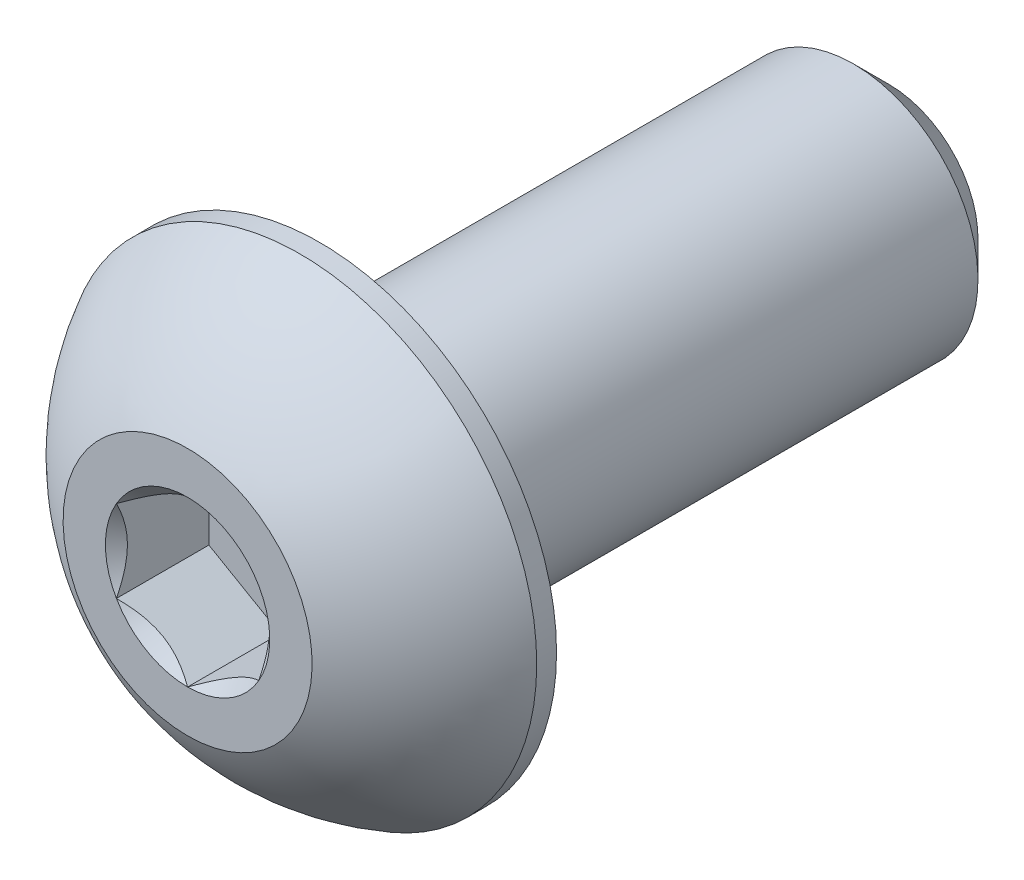
ISO-10303-21;
HEADER;
FILE_DESCRIPTION(('STEP AP214'),'2;1');
FILE_NAME('part.step','',(''),(''),'','','');
FILE_SCHEMA(('AUTOMOTIVE_DESIGN { 1 0 10303 214 1 1 1 1 }'));
ENDSEC;
DATA;
#1=APPLICATION_CONTEXT('core data for automotive mechanical design processes');
#2=APPLICATION_PROTOCOL_DEFINITION('international standard','automotive_design',2000,#1);
#3=PRODUCT_CONTEXT('',#1,'mechanical');
#4=PRODUCT('Part','Part','',(#3));
#5=PRODUCT_RELATED_PRODUCT_CATEGORY('part','',(#4));
#6=PRODUCT_DEFINITION_FORMATION('','',#4);
#7=PRODUCT_DEFINITION_CONTEXT('part definition',#1,'design');
#8=PRODUCT_DEFINITION('design','',#6,#7);
#9=PRODUCT_DEFINITION_SHAPE('','',#8);
#10=(LENGTH_UNIT() NAMED_UNIT(*) SI_UNIT(.MILLI.,.METRE.));
#11=(NAMED_UNIT(*) PLANE_ANGLE_UNIT() SI_UNIT($,.RADIAN.));
#12=(NAMED_UNIT(*) SI_UNIT($,.STERADIAN.) SOLID_ANGLE_UNIT());
#13=UNCERTAINTY_MEASURE_WITH_UNIT(LENGTH_MEASURE(1.E-05),#10,'distance_accuracy_value','');
#14=(GEOMETRIC_REPRESENTATION_CONTEXT(3) GLOBAL_UNCERTAINTY_ASSIGNED_CONTEXT((#13)) GLOBAL_UNIT_ASSIGNED_CONTEXT((#10,
#11,#12)) REPRESENTATION_CONTEXT('',''));
#15=CARTESIAN_POINT('',(0.,0.,0.));
#16=DIRECTION('',(0.,0.,1.));
#17=DIRECTION('',(1.,0.,0.));
#18=AXIS2_PLACEMENT_3D('',#15,#16,#17);
#19=CARTESIAN_POINT('',(0.,-2.08280000000001,-11.7348));
#20=DIRECTION('',(0.,0.,-1.));
#21=DIRECTION('',(0.,1.,0.));
#22=AXIS2_PLACEMENT_3D('',#19,#20,#21);
#23=PLANE('',#22);
#24=CARTESIAN_POINT('',(0.,0.,-11.7348));
#25=DIRECTION('',(0.,0.,-1.));
#26=DIRECTION('',(0.,1.,0.));
#27=AXIS2_PLACEMENT_3D('',#24,#25,#26);
#28=CIRCLE('',#27,1.4874875);
#29=CARTESIAN_POINT('',(0.,1.4874875,-11.7348));
#30=VERTEX_POINT('',#29);
#31=EDGE_CURVE('E174',#30,#30,#28,.T.);
#32=ORIENTED_EDGE('',*,*,#31,.T.);
#33=EDGE_LOOP('',(#32));
#34=FACE_BOUND('',#33,.T.);
#35=ADVANCED_FACE('F35',(#34),#23,.T.);
#36=CARTESIAN_POINT('',(0.,0.,-11.7348));
#37=DIRECTION('',(0.,0.,-1.));
#38=DIRECTION('',(0.,1.,0.));
#39=AXIS2_PLACEMENT_3D('',#36,#37,#38);
#40=CYLINDRICAL_SURFACE('',#39,2.0828);
#41=CARTESIAN_POINT('',(0.,0.,-11.1394875));
#42=DIRECTION('',(0.,0.,-1.));
#43=DIRECTION('',(0.,1.,0.));
#44=AXIS2_PLACEMENT_3D('',#41,#42,#43);
#45=CIRCLE('',#44,2.0828);
#46=CARTESIAN_POINT('',(0.,2.0828,-11.1394875));
#47=VERTEX_POINT('',#46);
#48=EDGE_CURVE('E48',#47,#47,#45,.F.);
#49=ORIENTED_EDGE('',*,*,#48,.T.);
#50=EDGE_LOOP('',(#49));
#51=FACE_BOUND('',#50,.T.);
#52=CARTESIAN_POINT('',(0.,0.,-2.2098));
#53=DIRECTION('',(0.,0.,1.));
#54=DIRECTION('',(1.,0.,0.));
#55=AXIS2_PLACEMENT_3D('',#52,#53,#54);
#56=CIRCLE('',#55,2.0828);
#57=CARTESIAN_POINT('',(2.0828,0.,-2.2098));
#58=VERTEX_POINT('',#57);
#59=EDGE_CURVE('E171',#58,#58,#56,.F.);
#60=ORIENTED_EDGE('',*,*,#59,.T.);
#61=EDGE_LOOP('',(#60));
#62=FACE_BOUND('',#61,.T.);
#63=ADVANCED_FACE('F179',(#51,#62),#40,.T.);
#64=CARTESIAN_POINT('',(0.,0.,-11.7348));
#65=DIRECTION('',(0.,0.,1.));
#66=DIRECTION('',(0.,-1.,0.));
#67=AXIS2_PLACEMENT_3D('',#64,#65,#66);
#68=CONICAL_SURFACE('',#67,1.4874875,0.785398163397446);
#69=ORIENTED_EDGE('',*,*,#48,.F.);
#70=EDGE_LOOP('',(#69));
#71=FACE_BOUND('',#70,.T.);
#72=ORIENTED_EDGE('',*,*,#31,.F.);
#73=EDGE_LOOP('',(#72));
#74=FACE_BOUND('',#73,.T.);
#75=ADVANCED_FACE('F37',(#71,#74),#68,.T.);
#76=CARTESIAN_POINT('',(0.,0.,-3.96380867816092));
#77=DIRECTION('',(0.,0.,1.));
#78=DIRECTION('',(0.,-1.,0.));
#79=AXIS2_PLACEMENT_3D('',#76,#77,#78);
#80=SPHERICAL_SURFACE('',#79,4.47770421947049);
#81=CARTESIAN_POINT('',(0.,0.,0.));
#82=DIRECTION('',(0.,0.,1.));
#83=DIRECTION('',(1.,0.,0.));
#84=AXIS2_PLACEMENT_3D('',#81,#82,#83);
#85=CIRCLE('',#84,2.0828);
#86=CARTESIAN_POINT('',(0.,-2.0828,0.));
#87=VERTEX_POINT('',#86);
#88=EDGE_CURVE('E168',#87,#87,#85,.T.);
#89=CARTESIAN_POINT('',(0.,0.,-1.87833));
#90=DIRECTION('',(0.,0.,1.));
#91=DIRECTION('',(1.,0.,0.));
#92=AXIS2_PLACEMENT_3D('',#89,#90,#91);
#93=CIRCLE('',#92,3.9624);
#94=CARTESIAN_POINT('',(0.,-3.9624,-1.87833));
#95=VERTEX_POINT('',#94);
#96=EDGE_CURVE('E162',#95,#95,#93,.T.);
#97=CARTESIAN_POINT('',(0.,-2.0828,0.));
#98=CARTESIAN_POINT('',(0.,-2.10767763915469,-0.0130720224519118));
#99=CARTESIAN_POINT('',(0.,-2.13243218251379,-0.0263783080421214));
#100=CARTESIAN_POINT('',(0.,-2.18168637330346,-0.0534545587178047));
#101=CARTESIAN_POINT('',(0.,-2.20618602073402,-0.0672245238032785));
#102=CARTESIAN_POINT('',(0.,-2.25492171532922,-0.0952232866881573));
#103=CARTESIAN_POINT('',(0.,-2.27915776249386,-0.109452084487562));
#104=CARTESIAN_POINT('',(0.,-2.32735766987977,-0.138363459316015));
#105=CARTESIAN_POINT('',(0.,-2.35132153010104,-0.153046036345062));
#106=CARTESIAN_POINT('',(0.,-2.39896856692664,-0.18285976708332));
#107=CARTESIAN_POINT('',(0.,-2.42265174353097,-0.197990920792531));
#108=CARTESIAN_POINT('',(0.,-2.46972901769116,-0.22869644015681));
#109=CARTESIAN_POINT('',(0.,-2.49312311524702,-0.244270805811878));
#110=CARTESIAN_POINT('',(0.,-2.53961393789287,-0.275857228060144));
#111=CARTESIAN_POINT('',(0.,-2.56271066298285,-0.291869284653343));
#112=CARTESIAN_POINT('',(0.,-2.60859855282429,-0.324325412379582));
#113=CARTESIAN_POINT('',(0.,-2.63138971757574,-0.340769483512622));
#114=CARTESIAN_POINT('',(0.,-2.67665840715661,-0.37408381082988));
#115=CARTESIAN_POINT('',(0.,-2.69913593198603,-0.390954067014097));
#116=CARTESIAN_POINT('',(0.,-2.74376937333514,-0.425114783844113));
#117=CARTESIAN_POINT('',(0.,-2.76592528985483,-0.442405244489911));
#118=CARTESIAN_POINT('',(0.,-2.80990766020607,-0.477400240693378));
#119=CARTESIAN_POINT('',(0.,-2.83173411403762,-0.495104776251046));
#120=CARTESIAN_POINT('',(0.,-2.8750498214309,-0.530921645935844));
#121=CARTESIAN_POINT('',(0.,-2.89653907499262,-0.549033980062974));
#122=CARTESIAN_POINT('',(0.,-2.93917276380349,-0.585660025978065));
#123=CARTESIAN_POINT('',(0.,-2.96031719905264,-0.604173737766026));
#124=CARTESIAN_POINT('',(0.,-3.00225375543539,-0.641595975803774));
#125=CARTESIAN_POINT('',(0.,-3.02304587656898,-0.66050450205356));
#126=CARTESIAN_POINT('',(0.,-3.06427043381468,-0.698709665852367));
#127=CARTESIAN_POINT('',(0.,-3.08470286992677,-0.718006303401387));
#128=CARTESIAN_POINT('',(0.,-3.12520081373355,-0.756980849048763));
#129=CARTESIAN_POINT('',(0.,-3.14526632142825,-0.776658757147117));
#130=CARTESIAN_POINT('',(0.,-3.1850232950822,-0.816388867981036));
#131=CARTESIAN_POINT('',(0.,-3.20471476104147,-0.836441070716601));
#132=CARTESIAN_POINT('',(0.,-3.24371667050612,-0.876912662223586));
#133=CARTESIAN_POINT('',(0.,-3.2630271140115,-0.897332050995006));
#134=CARTESIAN_POINT('',(0.,-3.30126013292422,-0.938530775803146));
#135=CARTESIAN_POINT('',(0.,-3.32018270833155,-0.959310111839867));
#136=CARTESIAN_POINT('',(0.,-3.35763328290506,-1.00122136480503));
#137=CARTESIAN_POINT('',(0.,-3.37616128207125,-1.02235328173348));
#138=CARTESIAN_POINT('',(0.,-3.41281613589854,-1.06496220511693));
#139=CARTESIAN_POINT('',(0.,-3.43094299055964,-1.08643921157194));
#140=CARTESIAN_POINT('',(0.,-3.46678912932052,-1.12973070030741));
#141=CARTESIAN_POINT('',(0.,-3.4845084134203,-1.15154518258787));
#142=CARTESIAN_POINT('',(0.,-3.51953312948771,-1.19550388963656));
#143=CARTESIAN_POINT('',(0.,-3.53683856145534,-1.21764811440477));
#144=CARTESIAN_POINT('',(0.,-3.57102943840132,-1.26225845619532));
#145=CARTESIAN_POINT('',(0.,-3.58791488337967,-1.28472457321766));
#146=CARTESIAN_POINT('',(0.,-3.62125980037301,-1.32997073517287));
#147=CARTESIAN_POINT('',(0.,-3.637719272388,-1.35275078010575));
#148=CARTESIAN_POINT('',(0.,-3.67020640850626,-1.39861672224058));
#149=CARTESIAN_POINT('',(0.,-3.68623407260953,-1.42170261944253));
#150=CARTESIAN_POINT('',(0.,-3.71785191097313,-1.46817208208141));
#151=CARTESIAN_POINT('',(0.,-3.73344208523347,-1.49155564751835));
#152=CARTESIAN_POINT('',(0.,-3.76417941729919,-1.53861215694335));
#153=CARTESIAN_POINT('',(0.,-3.77932657510458,-1.56228510093141));
#154=CARTESIAN_POINT('',(0.,-3.80917250385283,-1.60991197565512));
#155=CARTESIAN_POINT('',(0.,-3.82387127479568,-1.63386590639077));
#156=CARTESIAN_POINT('',(0.,-3.85281522152763,-1.68204626145442));
#157=CARTESIAN_POINT('',(0.,-3.86706039731673,-1.70627268578243));
#158=CARTESIAN_POINT('',(0.,-3.89509209445425,-1.754989444771));
#159=CARTESIAN_POINT('',(0.,-3.90887861580268,-1.77947977943156));
#160=CARTESIAN_POINT('',(0.,-3.93598815139536,-1.8287156580258));
#161=CARTESIAN_POINT('',(0.,-3.94931116563961,-1.85346120195948));
#162=CARTESIAN_POINT('',(0.,-3.9624,-1.87833));
#163=B_SPLINE_CURVE_WITH_KNOTS('',3,(#97,#98,#99,#100,#101,#102,#103,#104,#105,#106,#107,#108,
#109,#110,#111,#112,#113,#114,#115,#116,#117,#118,#119,#120,#121,#122,#123,#124,#125,#126,#127,
#128,#129,#130,#131,#132,#133,#134,#135,#136,#137,#138,#139,#140,#141,#142,#143,#144,#145,#146,
#147,#148,#149,#150,#151,#152,#153,#154,#155,#156,#157,#158,#159,#160,#161,#162),.UNSPECIFIED.,
.F.,.F.,(4,2,2,2,2,2,2,2,2,2,2,2,2,2,2,2,2,2,2,2,2,2,2,2,2,2,2,2,2,2,2,2,4),(0.,
0.0843075442014962,0.168615088402992,0.252922632604488,0.337230176805985,0.421537721007481,
0.505845265208977,0.590152809410473,0.674460353611969,0.758767897813466,0.843075442014961,
0.927382986216458,1.01169053041795,1.09599807461945,1.18030561882095,1.26461316302244,
1.34892070722394,1.43322825142543,1.51753579562693,1.60184333982843,1.68615088402992,
1.77045842823142,1.85476597243292,1.93907351663441,2.02338106083591,2.1076886050374,
2.1919961492389,2.2763036934404,2.36061123764189,2.44491878184339,2.52922632604488,
2.61353387024638,2.69784141444788),.UNSPECIFIED.);
#164=EDGE_CURVE('BSEAM184',#87,#95,#163,.T.);
#165=ORIENTED_EDGE('',*,*,#88,.F.);
#166=ORIENTED_EDGE('',*,*,#96,.T.);
#167=ORIENTED_EDGE('',*,*,#164,.T.);
#168=ORIENTED_EDGE('',*,*,#164,.F.);
#169=EDGE_LOOP('',(#165,#167,#166,#168));
#170=FACE_BOUND('',#169,.T.);
#171=ADVANCED_FACE('F184',(#170),#80,.T.);
#172=CARTESIAN_POINT('',(0.,-2.0828,0.));
#173=DIRECTION('',(0.,0.,-1.));
#174=DIRECTION('',(-1.,0.,0.));
#175=AXIS2_PLACEMENT_3D('',#172,#173,#174);
#176=PLANE('',#175);
#177=CARTESIAN_POINT('',(0.,0.,0.));
#178=DIRECTION('',(0.,0.,1.));
#179=DIRECTION('',(1.,0.,0.));
#180=AXIS2_PLACEMENT_3D('',#177,#178,#179);
#181=CIRCLE('',#180,1.3748153285078);
#182=CARTESIAN_POINT('',(-1.190625,0.687407664253898,0.));
#183=VERTEX_POINT('',#182);
#184=CARTESIAN_POINT('',(-1.190625,-0.687407664253899,0.));
#185=VERTEX_POINT('',#184);
#186=EDGE_CURVE('E61',#183,#185,#181,.T.);
#187=ORIENTED_EDGE('',*,*,#186,.F.);
#188=CARTESIAN_POINT('',(0.,1.3748153285078,0.));
#189=VERTEX_POINT('',#188);
#190=EDGE_CURVE('E133',#189,#183,#181,.T.);
#191=ORIENTED_EDGE('',*,*,#190,.F.);
#192=CARTESIAN_POINT('',(1.190625,0.687407664253899,0.));
#193=VERTEX_POINT('',#192);
#194=EDGE_CURVE('E130',#193,#189,#181,.T.);
#195=ORIENTED_EDGE('',*,*,#194,.F.);
#196=CARTESIAN_POINT('',(1.190625,-0.687407664253899,0.));
#197=VERTEX_POINT('',#196);
#198=EDGE_CURVE('E101',#197,#193,#181,.T.);
#199=ORIENTED_EDGE('',*,*,#198,.F.);
#200=CARTESIAN_POINT('',(0.,-1.3748153285078,0.));
#201=VERTEX_POINT('',#200);
#202=EDGE_CURVE('E93',#201,#197,#181,.T.);
#203=ORIENTED_EDGE('',*,*,#202,.F.);
#204=EDGE_CURVE('E54',#185,#201,#181,.T.);
#205=ORIENTED_EDGE('',*,*,#204,.F.);
#206=EDGE_LOOP('',(#187,#191,#195,#199,#203,#205));
#207=FACE_BOUND('',#206,.T.);
#208=ORIENTED_EDGE('',*,*,#88,.T.);
#209=EDGE_LOOP('',(#208));
#210=FACE_BOUND('',#209,.T.);
#211=ADVANCED_FACE('F127',(#207,#210),#176,.F.);
#212=CARTESIAN_POINT('',(0.,-3.9624,-2.2098));
#213=DIRECTION('',(0.,0.,1.));
#214=DIRECTION('',(1.,0.,0.));
#215=AXIS2_PLACEMENT_3D('',#212,#213,#214);
#216=PLANE('',#215);
#217=ORIENTED_EDGE('',*,*,#59,.F.);
#218=EDGE_LOOP('',(#217));
#219=FACE_BOUND('',#218,.T.);
#220=CARTESIAN_POINT('',(0.,0.,-2.2098));
#221=DIRECTION('',(0.,0.,1.));
#222=DIRECTION('',(1.,0.,0.));
#223=AXIS2_PLACEMENT_3D('',#220,#221,#222);
#224=CIRCLE('',#223,3.9624);
#225=CARTESIAN_POINT('',(3.9624,0.,-2.2098));
#226=VERTEX_POINT('',#225);
#227=EDGE_CURVE('E165',#226,#226,#224,.T.);
#228=ORIENTED_EDGE('',*,*,#227,.F.);
#229=EDGE_LOOP('',(#228));
#230=FACE_BOUND('',#229,.T.);
#231=ADVANCED_FACE('F198',(#219,#230),#216,.F.);
#232=CARTESIAN_POINT('',(0.,0.,0.));
#233=DIRECTION('',(0.,0.,1.));
#234=DIRECTION('',(1.,0.,0.));
#235=AXIS2_PLACEMENT_3D('',#232,#233,#234);
#236=CYLINDRICAL_SURFACE('',#235,3.9624);
#237=ORIENTED_EDGE('',*,*,#96,.F.);
#238=EDGE_LOOP('',(#237));
#239=FACE_BOUND('',#238,.T.);
#240=ORIENTED_EDGE('',*,*,#227,.T.);
#241=EDGE_LOOP('',(#240));
#242=FACE_BOUND('',#241,.T.);
#243=ADVANCED_FACE('F201',(#239,#242),#236,.T.);
#244=CARTESIAN_POINT('',(0.,0.,0.));
#245=DIRECTION('',(0.,0.,1.));
#246=DIRECTION('',(1.,0.,0.));
#247=AXIS2_PLACEMENT_3D('',#244,#245,#246);
#248=CONICAL_SURFACE('',#247,1.3748153285078,0.78539816339745);
#249=ORIENTED_EDGE('',*,*,#198,.T.);
#250=CARTESIAN_POINT('',(1.190625,-1.37097145294693,0.44099044728994));
#251=CARTESIAN_POINT('',(1.190625,-1.3375892063789,0.415789988807826));
#252=CARTESIAN_POINT('',(1.190625,-1.30402095496658,0.39083662023745));
#253=CARTESIAN_POINT('',(1.190625,-1.23643692297761,0.341526087177203));
#254=CARTESIAN_POINT('',(1.190625,-1.20242103219112,0.317169073899369));
#255=CARTESIAN_POINT('',(1.190625,-1.09909081482554,0.244798208989214));
#256=CARTESIAN_POINT('',(1.190625,-1.02900143506767,0.197872622595561));
#257=CARTESIAN_POINT('',(1.190625,-0.882026737424228,0.105752103325632));
#258=CARTESIAN_POINT('',(1.190625,-0.80498186601998,0.0608088372420604));
#259=CARTESIAN_POINT('',(1.190625,-0.647043893307964,-0.0214019754931318));
#260=CARTESIAN_POINT('',(1.190625,-0.56616494370292,-0.058695398267878));
#261=CARTESIAN_POINT('',(1.190625,-0.444764933868855,-0.104320444436902));
#262=CARTESIAN_POINT('',(1.190625,-0.406041211486712,-0.117415160978515));
#263=CARTESIAN_POINT('',(1.190625,-0.327658904711932,-0.140495724103359));
#264=CARTESIAN_POINT('',(1.190625,-0.288000256118251,-0.150481356514043));
#265=CARTESIAN_POINT('',(1.190625,-0.208647693212096,-0.166658770934747));
#266=CARTESIAN_POINT('',(1.190625,-0.168967240621961,-0.172915554151022));
#267=CARTESIAN_POINT('',(1.190625,-0.0891819742965327,-0.181513111581485));
#268=CARTESIAN_POINT('',(1.190625,-0.0490772347013119,-0.183854558950103));
#269=CARTESIAN_POINT('',(1.190625,0.0297075773931769,-0.184447755932347));
#270=CARTESIAN_POINT('',(1.190625,0.068386606828809,-0.182844646203951));
#271=CARTESIAN_POINT('',(1.190625,0.14541687663315,-0.175956972255488));
#272=CARTESIAN_POINT('',(1.190625,0.183768052740679,-0.170671702331516));
#273=CARTESIAN_POINT('',(1.190625,0.260508634904944,-0.156618587767133));
#274=CARTESIAN_POINT('',(1.190625,0.298887052039132,-0.14779163739419));
#275=CARTESIAN_POINT('',(1.190625,0.374805334250663,-0.127124290019378));
#276=CARTESIAN_POINT('',(1.190625,0.412345269207094,-0.115284145164061));
#277=CARTESIAN_POINT('',(1.190625,0.530535580908839,-0.0735526663328066));
#278=CARTESIAN_POINT('',(1.190625,0.609503725744447,-0.0389086030856526));
#279=CARTESIAN_POINT('',(1.190625,0.763730269113466,0.0381182519748632));
#280=CARTESIAN_POINT('',(1.190625,0.838974064674605,0.0805288466686658));
#281=CARTESIAN_POINT('',(1.190625,0.982775796189618,0.168025645024959));
#282=CARTESIAN_POINT('',(1.190625,1.05148016607044,0.212874162055227));
#283=CARTESIAN_POINT('',(1.190625,1.15270222256253,0.282205329922607));
#284=CARTESIAN_POINT('',(1.190625,1.18600604145834,0.305560176337173));
#285=CARTESIAN_POINT('',(1.190625,1.25215860362232,0.35288756901931));
#286=CARTESIAN_POINT('',(1.190625,1.28500746868279,0.376859944858282));
#287=CARTESIAN_POINT('',(1.190625,1.31766689427973,0.401088366771255));
#288=B_SPLINE_CURVE_WITH_KNOTS('',3,(#250,#251,#252,#253,#254,#255,#256,#257,#258,#259,#260,
#261,#262,#263,#264,#265,#266,#267,#268,#269,#270,#271,#272,#273,#274,#275,#276,#277,#278,#279,
#280,#281,#282,#283,#284,#285,#286,#287),.UNSPECIFIED.,.F.,.F.,(4,2,2,2,2,2,2,2,2,2,2,2,2,2,2,2,
2,2,4),(0.,0.125475644763329,0.250982782413966,0.503912518769173,0.771279184643224,
1.03772598255657,1.16025581644629,1.28279408906665,1.40312855503246,1.5234423300503,
1.63939577664877,1.75537145240477,1.87336894094838,1.99135655861152,2.24929724983449,
2.50818004711563,2.75419821472196,2.87622362118596,2.99821570388961),.UNSPECIFIED.);
#289=EDGE_CURVE('E11',#197,#193,#288,.T.);
#290=ORIENTED_EDGE('',*,*,#289,.F.);
#291=EDGE_LOOP('',(#249,#290));
#292=FACE_BOUND('',#291,.T.);
#293=ADVANCED_FACE('F105',(#292),#248,.F.);
#294=ORIENTED_EDGE('',*,*,#194,.T.);
#295=CARTESIAN_POINT('',(1.190825,0.68729219420006,0.000115484600023907));
#296=CARTESIAN_POINT('',(1.14989058041014,0.710925692369385,-0.0235012357857369));
#297=CARTESIAN_POINT('',(1.10827161169803,0.734954415158721,-0.0457312182768795));
#298=CARTESIAN_POINT('',(1.02340555632637,0.783951855072609,-0.0864343373725631));
#299=CARTESIAN_POINT('',(0.980150392709039,0.808925235430915,-0.104884817352449));
#300=CARTESIAN_POINT('',(0.892928352542576,0.859282903800291,-0.136491161995679));
#301=CARTESIAN_POINT('',(0.848983705042075,0.884654357864149,-0.149726495756684));
#302=CARTESIAN_POINT('',(0.760126625836306,0.935956016463003,-0.170118548424605));
#303=CARTESIAN_POINT('',(0.715216911165245,0.96188465231757,-0.177290497104008));
#304=CARTESIAN_POINT('',(0.637820872343022,1.00656927616579,-0.183761461351144));
#305=CARTESIAN_POINT('',(0.605434587484353,1.025267506447,-0.18471967985321));
#306=CARTESIAN_POINT('',(0.54071892668223,1.06263111063189,-0.183107350927916));
#307=CARTESIAN_POINT('',(0.508389564872727,1.08129647637533,-0.180536024820421));
#308=CARTESIAN_POINT('',(0.444042843928515,1.11844707303394,-0.172013246006379));
#309=CARTESIAN_POINT('',(0.412025803663232,1.13693211984976,-0.166058645247436));
#310=CARTESIAN_POINT('',(0.348526236603543,1.17359361198509,-0.1510900359288));
#311=CARTESIAN_POINT('',(0.317043945355836,1.19176992131166,-0.142074714087946));
#312=CARTESIAN_POINT('',(0.236410161427873,1.23832385816825,-0.115317704161983));
#313=CARTESIAN_POINT('',(0.187767164732342,1.26640790540461,-0.0955631855639916));
#314=CARTESIAN_POINT('',(0.0923855836478807,1.32147648691945,-0.0510632310423197));
#315=CARTESIAN_POINT('',(0.0456413824128441,1.34846426408555,-0.026334035283841));
#316=CARTESIAN_POINT('',(-0.000200000000000358,1.37493079856163,0.000115484600024344));
#317=B_SPLINE_CURVE_WITH_KNOTS('',3,(#295,#296,#297,#298,#299,#300,#301,#302,#303,#304,#305,
#306,#307,#308,#309,#310,#311,#312,#313,#314,#315,#316),.UNSPECIFIED.,.F.,.F.,(4,2,2,2,2,2,2,2,
2,2,4),(0.,0.15862567293412,0.318176079843271,0.475191357500655,0.631811068630749,
0.743878551794718,0.855970763007029,0.968167444423242,1.08041232768377,1.25873351645467,
1.43648174479847),.UNSPECIFIED.);
#318=EDGE_CURVE('E132',#193,#189,#317,.T.);
#319=ORIENTED_EDGE('',*,*,#318,.F.);
#320=EDGE_LOOP('',(#294,#319));
#321=FACE_BOUND('',#320,.T.);
#322=ADVANCED_FACE('F281',(#321),#248,.F.);
#323=ORIENTED_EDGE('',*,*,#190,.T.);
#324=CARTESIAN_POINT('',(0.000199999999999495,1.37493079856163,0.000115484600024211));
#325=CARTESIAN_POINT('',(-0.0407344195898567,1.35129730039231,-0.0235012357857363));
#326=CARTESIAN_POINT('',(-0.0823533883019742,1.32726857760297,-0.045731218276879));
#327=CARTESIAN_POINT('',(-0.167219443673633,1.27827113768909,-0.0864343373725627));
#328=CARTESIAN_POINT('',(-0.210474607290961,1.25329775733078,-0.104884817352448));
#329=CARTESIAN_POINT('',(-0.297696647457424,1.2029400889614,-0.136491161995679));
#330=CARTESIAN_POINT('',(-0.341641294957925,1.17756863489755,-0.149726495756683));
#331=CARTESIAN_POINT('',(-0.430498374163694,1.12626697629869,-0.170118548424605));
#332=CARTESIAN_POINT('',(-0.475408088834755,1.10033834044413,-0.177290497104008));
#333=CARTESIAN_POINT('',(-0.552804127656978,1.0556537165959,-0.183761461351144));
#334=CARTESIAN_POINT('',(-0.585190412515646,1.0369554863147,-0.18471967985321));
#335=CARTESIAN_POINT('',(-0.64990607331777,0.99959188212981,-0.183107350927916));
#336=CARTESIAN_POINT('',(-0.682235435127272,0.980926516386364,-0.180536024820421));
#337=CARTESIAN_POINT('',(-0.746582156071484,0.943775919727754,-0.172013246006379));
#338=CARTESIAN_POINT('',(-0.778599196336768,0.925290872911937,-0.166058645247436));
#339=CARTESIAN_POINT('',(-0.842098763396457,0.888629380776601,-0.1510900359288));
#340=CARTESIAN_POINT('',(-0.873581054644164,0.870453071450031,-0.142074714087946));
#341=CARTESIAN_POINT('',(-0.954214838572126,0.823899134593444,-0.115317704161984));
#342=CARTESIAN_POINT('',(-1.00285783526766,0.795815087357089,-0.0955631855639919));
#343=CARTESIAN_POINT('',(-1.09823941635212,0.740746505842243,-0.0510632310423202));
#344=CARTESIAN_POINT('',(-1.14498361758716,0.713758728676141,-0.0263340352838417));
#345=CARTESIAN_POINT('',(-1.190825,0.68729219420006,0.000115484600023614));
#346=B_SPLINE_CURVE_WITH_KNOTS('',3,(#324,#325,#326,#327,#328,#329,#330,#331,#332,#333,#334,
#335,#336,#337,#338,#339,#340,#341,#342,#343,#344,#345),.UNSPECIFIED.,.F.,.F.,(4,2,2,2,2,2,2,2,
2,2,4),(0.,0.15862567293412,0.318176079843271,0.475191357500655,0.631811068630748,
0.743878551794718,0.855970763007028,0.968167444423241,1.08041232768376,1.25873351645467,
1.43648174479847),.UNSPECIFIED.);
#347=EDGE_CURVE('E137',#189,#183,#346,.T.);
#348=ORIENTED_EDGE('',*,*,#347,.F.);
#349=EDGE_LOOP('',(#323,#348));
#350=FACE_BOUND('',#349,.T.);
#351=ADVANCED_FACE('F140',(#350),#248,.F.);
#352=ORIENTED_EDGE('',*,*,#186,.T.);
#353=CARTESIAN_POINT('',(-1.190625,-1.37097145294693,0.440990447289941));
#354=CARTESIAN_POINT('',(-1.190625,-1.3375892063789,0.415789988807826));
#355=CARTESIAN_POINT('',(-1.190625,-1.30402095496658,0.39083662023745));
#356=CARTESIAN_POINT('',(-1.190625,-1.23643692297761,0.341526087177203));
#357=CARTESIAN_POINT('',(-1.190625,-1.20242103219112,0.317169073899369));
#358=CARTESIAN_POINT('',(-1.190625,-1.09909081482554,0.244798208989214));
#359=CARTESIAN_POINT('',(-1.190625,-1.02900143506767,0.197872622595562));
#360=CARTESIAN_POINT('',(-1.190625,-0.882026737424229,0.105752103325632));
#361=CARTESIAN_POINT('',(-1.190625,-0.80498186601998,0.0608088372420604));
#362=CARTESIAN_POINT('',(-1.190625,-0.647043893307964,-0.0214019754931318));
#363=CARTESIAN_POINT('',(-1.190625,-0.56616494370292,-0.0586953982678779));
#364=CARTESIAN_POINT('',(-1.190625,-0.444764933868855,-0.104320444436902));
#365=CARTESIAN_POINT('',(-1.190625,-0.406041211486713,-0.117415160978515));
#366=CARTESIAN_POINT('',(-1.190625,-0.327658904711932,-0.140495724103359));
#367=CARTESIAN_POINT('',(-1.190625,-0.288000256118252,-0.150481356514043));
#368=CARTESIAN_POINT('',(-1.190625,-0.208647693212096,-0.166658770934748));
#369=CARTESIAN_POINT('',(-1.190625,-0.168967240621961,-0.172915554151022));
#370=CARTESIAN_POINT('',(-1.190625,-0.0891819742965331,-0.181513111581485));
#371=CARTESIAN_POINT('',(-1.190625,-0.0490772347013122,-0.183854558950103));
#372=CARTESIAN_POINT('',(-1.190625,0.0297075773931766,-0.184447755932347));
#373=CARTESIAN_POINT('',(-1.190625,0.0683866068288087,-0.182844646203951));
#374=CARTESIAN_POINT('',(-1.190625,0.14541687663315,-0.175956972255488));
#375=CARTESIAN_POINT('',(-1.190625,0.183768052740679,-0.170671702331516));
#376=CARTESIAN_POINT('',(-1.190625,0.260508634904944,-0.156618587767133));
#377=CARTESIAN_POINT('',(-1.190625,0.298887052039132,-0.147791637394191));
#378=CARTESIAN_POINT('',(-1.190625,0.374805334250663,-0.127124290019378));
#379=CARTESIAN_POINT('',(-1.190625,0.412345269207094,-0.115284145164062));
#380=CARTESIAN_POINT('',(-1.190625,0.530535580908839,-0.0735526663328068));
#381=CARTESIAN_POINT('',(-1.190625,0.609503725744447,-0.0389086030856529));
#382=CARTESIAN_POINT('',(-1.190625,0.763730269113466,0.0381182519748631));
#383=CARTESIAN_POINT('',(-1.190625,0.838974064674605,0.0805288466686658));
#384=CARTESIAN_POINT('',(-1.190625,0.982775796189618,0.168025645024959));
#385=CARTESIAN_POINT('',(-1.190625,1.05148016607044,0.212874162055227));
#386=CARTESIAN_POINT('',(-1.190625,1.15270222256253,0.282205329922607));
#387=CARTESIAN_POINT('',(-1.190625,1.18600604145834,0.305560176337173));
#388=CARTESIAN_POINT('',(-1.190625,1.25215860362232,0.35288756901931));
#389=CARTESIAN_POINT('',(-1.190625,1.28500746868279,0.376859944858282));
#390=CARTESIAN_POINT('',(-1.190625,1.31766689427973,0.401088366771255));
#391=B_SPLINE_CURVE_WITH_KNOTS('',3,(#353,#354,#355,#356,#357,#358,#359,#360,#361,#362,#363,
#364,#365,#366,#367,#368,#369,#370,#371,#372,#373,#374,#375,#376,#377,#378,#379,#380,#381,#382,
#383,#384,#385,#386,#387,#388,#389,#390),.UNSPECIFIED.,.F.,.F.,(4,2,2,2,2,2,2,2,2,2,2,2,2,2,2,2,
2,2,4),(0.,0.125475644763329,0.250982782413966,0.503912518769173,0.771279184643224,
1.03772598255657,1.16025581644629,1.28279408906665,1.40312855503246,1.5234423300503,
1.63939577664877,1.75537145240477,1.87336894094838,1.99135655861152,2.24929724983449,
2.50818004711563,2.75419821472196,2.87622362118597,2.99821570388961),.UNSPECIFIED.);
#392=EDGE_CURVE('E144',#183,#185,#391,.F.);
#393=ORIENTED_EDGE('',*,*,#392,.F.);
#394=EDGE_LOOP('',(#352,#393));
#395=FACE_BOUND('',#394,.T.);
#396=ADVANCED_FACE('F275',(#395),#248,.F.);
#397=ORIENTED_EDGE('',*,*,#204,.T.);
#398=CARTESIAN_POINT('',(-1.190825,-0.687292194200061,0.000115484600023906));
#399=CARTESIAN_POINT('',(-1.14989058041014,-0.710925692369385,-0.0235012357857368));
#400=CARTESIAN_POINT('',(-1.10827161169803,-0.734954415158721,-0.0457312182768794));
#401=CARTESIAN_POINT('',(-1.02340555632637,-0.783951855072609,-0.086434337372563));
#402=CARTESIAN_POINT('',(-0.980150392709039,-0.808925235430915,-0.104884817352449));
#403=CARTESIAN_POINT('',(-0.892928352542576,-0.859282903800291,-0.136491161995679));
#404=CARTESIAN_POINT('',(-0.848983705042075,-0.884654357864149,-0.149726495756684));
#405=CARTESIAN_POINT('',(-0.760126625836306,-0.935956016463003,-0.170118548424605));
#406=CARTESIAN_POINT('',(-0.715216911165245,-0.961884652317569,-0.177290497104008));
#407=CARTESIAN_POINT('',(-0.637820872343022,-1.00656927616579,-0.183761461351144));
#408=CARTESIAN_POINT('',(-0.605434587484353,-1.02526750644699,-0.18471967985321));
#409=CARTESIAN_POINT('',(-0.54071892668223,-1.06263111063189,-0.183107350927916));
#410=CARTESIAN_POINT('',(-0.508389564872727,-1.08129647637533,-0.180536024820421));
#411=CARTESIAN_POINT('',(-0.444042843928515,-1.11844707303394,-0.172013246006379));
#412=CARTESIAN_POINT('',(-0.412025803663232,-1.13693211984976,-0.166058645247436));
#413=CARTESIAN_POINT('',(-0.348526236603543,-1.17359361198509,-0.1510900359288));
#414=CARTESIAN_POINT('',(-0.317043945355836,-1.19176992131166,-0.142074714087946));
#415=CARTESIAN_POINT('',(-0.236410161427873,-1.23832385816825,-0.115317704161983));
#416=CARTESIAN_POINT('',(-0.187767164732342,-1.26640790540461,-0.0955631855639916));
#417=CARTESIAN_POINT('',(-0.0923855836478808,-1.32147648691945,-0.0510632310423198));
#418=CARTESIAN_POINT('',(-0.0456413824128442,-1.34846426408555,-0.0263340352838412));
#419=CARTESIAN_POINT('',(0.000200000000000431,-1.37493079856163,0.000115484600024223));
#420=B_SPLINE_CURVE_WITH_KNOTS('',3,(#398,#399,#400,#401,#402,#403,#404,#405,#406,#407,#408,
#409,#410,#411,#412,#413,#414,#415,#416,#417,#418,#419),.UNSPECIFIED.,.F.,.F.,(4,2,2,2,2,2,2,2,
2,2,4),(0.,0.15862567293412,0.318176079843271,0.475191357500655,0.631811068630748,
0.743878551794718,0.855970763007029,0.968167444423241,1.08041232768377,1.25873351645467,
1.43648174479847),.UNSPECIFIED.);
#421=EDGE_CURVE('E117',#185,#201,#420,.T.);
#422=ORIENTED_EDGE('',*,*,#421,.F.);
#423=EDGE_LOOP('',(#397,#422));
#424=FACE_BOUND('',#423,.T.);
#425=ADVANCED_FACE('F226',(#424),#248,.F.);
#426=ORIENTED_EDGE('',*,*,#202,.T.);
#427=CARTESIAN_POINT('',(-0.000199999999999412,-1.37493079856163,0.000115484600024211));
#428=CARTESIAN_POINT('',(0.0407344195898569,-1.35129730039231,-0.0235012357857364));
#429=CARTESIAN_POINT('',(0.0823533883019744,-1.32726857760297,-0.045731218276879));
#430=CARTESIAN_POINT('',(0.167219443673633,-1.27827113768909,-0.0864343373725627));
#431=CARTESIAN_POINT('',(0.210474607290961,-1.25329775733078,-0.104884817352448));
#432=CARTESIAN_POINT('',(0.297696647457424,-1.2029400889614,-0.136491161995679));
#433=CARTESIAN_POINT('',(0.341641294957925,-1.17756863489755,-0.149726495756684));
#434=CARTESIAN_POINT('',(0.430498374163694,-1.12626697629869,-0.170118548424605));
#435=CARTESIAN_POINT('',(0.475408088834755,-1.10033834044413,-0.177290497104008));
#436=CARTESIAN_POINT('',(0.552804127656978,-1.0556537165959,-0.183761461351144));
#437=CARTESIAN_POINT('',(0.585190412515647,-1.0369554863147,-0.18471967985321));
#438=CARTESIAN_POINT('',(0.64990607331777,-0.99959188212981,-0.183107350927916));
#439=CARTESIAN_POINT('',(0.682235435127273,-0.980926516386364,-0.180536024820421));
#440=CARTESIAN_POINT('',(0.746582156071485,-0.943775919727753,-0.172013246006379));
#441=CARTESIAN_POINT('',(0.778599196336768,-0.925290872911937,-0.166058645247436));
#442=CARTESIAN_POINT('',(0.842098763396457,-0.888629380776601,-0.1510900359288));
#443=CARTESIAN_POINT('',(0.873581054644164,-0.870453071450031,-0.142074714087946));
#444=CARTESIAN_POINT('',(0.954214838572127,-0.823899134593444,-0.115317704161983));
#445=CARTESIAN_POINT('',(1.00285783526766,-0.795815087357089,-0.0955631855639918));
#446=CARTESIAN_POINT('',(1.09823941635212,-0.740746505842243,-0.0510632310423199));
#447=CARTESIAN_POINT('',(1.14498361758716,-0.713758728676141,-0.0263340352838413));
#448=CARTESIAN_POINT('',(1.190825,-0.68729219420006,0.00011548460002403));
#449=B_SPLINE_CURVE_WITH_KNOTS('',3,(#427,#428,#429,#430,#431,#432,#433,#434,#435,#436,#437,
#438,#439,#440,#441,#442,#443,#444,#445,#446,#447,#448),.UNSPECIFIED.,.F.,.F.,(4,2,2,2,2,2,2,2,
2,2,4),(0.,0.15862567293412,0.318176079843271,0.475191357500655,0.631811068630748,
0.743878551794718,0.855970763007029,0.968167444423242,1.08041232768377,1.25873351645467,
1.43648174479847),.UNSPECIFIED.);
#450=EDGE_CURVE('E97',#201,#197,#449,.T.);
#451=ORIENTED_EDGE('',*,*,#450,.F.);
#452=EDGE_LOOP('',(#426,#451));
#453=FACE_BOUND('',#452,.T.);
#454=ADVANCED_FACE('F95',(#453),#248,.F.);
#455=CARTESIAN_POINT('',(1.190625,-0.687407664253898,-1.54686));
#456=DIRECTION('',(0.,0.,1.));
#457=DIRECTION('',(1.,0.,0.));
#458=AXIS2_PLACEMENT_3D('',#455,#456,#457);
#459=PLANE('',#458);
#460=DIRECTION('',(0.866025403784438,0.5,0.));
#461=VECTOR('',#460,1.);
#462=CARTESIAN_POINT('',(0.,-1.3748153285078,-1.54686));
#463=LINE('',#462,#461);
#464=CARTESIAN_POINT('',(0.,-1.3748153285078,-1.54686));
#465=VERTEX_POINT('',#464);
#466=CARTESIAN_POINT('',(1.190625,-0.687407664253898,-1.54686));
#467=VERTEX_POINT('',#466);
#468=EDGE_CURVE('E116',#465,#467,#463,.T.);
#469=ORIENTED_EDGE('',*,*,#468,.T.);
#470=DIRECTION('',(0.,1.,0.));
#471=VECTOR('',#470,1.);
#472=CARTESIAN_POINT('',(1.190625,-0.687407664253898,-1.54686));
#473=LINE('',#472,#471);
#474=CARTESIAN_POINT('',(1.190625,0.687407664253898,-1.54686));
#475=VERTEX_POINT('',#474);
#476=EDGE_CURVE('E121',#467,#475,#473,.T.);
#477=ORIENTED_EDGE('',*,*,#476,.T.);
#478=DIRECTION('',(-0.866025403784439,0.5,0.));
#479=VECTOR('',#478,1.);
#480=CARTESIAN_POINT('',(1.190625,0.687407664253898,-1.54686));
#481=LINE('',#480,#479);
#482=CARTESIAN_POINT('',(0.,1.3748153285078,-1.54686));
#483=VERTEX_POINT('',#482);
#484=EDGE_CURVE('E265',#475,#483,#481,.T.);
#485=ORIENTED_EDGE('',*,*,#484,.T.);
#486=DIRECTION('',(-0.866025403784438,-0.5,0.));
#487=VECTOR('',#486,1.);
#488=CARTESIAN_POINT('',(0.,1.3748153285078,-1.54686));
#489=LINE('',#488,#487);
#490=CARTESIAN_POINT('',(-1.190625,0.687407664253898,-1.54686));
#491=VERTEX_POINT('',#490);
#492=EDGE_CURVE('E153',#483,#491,#489,.T.);
#493=ORIENTED_EDGE('',*,*,#492,.T.);
#494=DIRECTION('',(0.,-1.,0.));
#495=VECTOR('',#494,1.);
#496=CARTESIAN_POINT('',(-1.190625,0.687407664253898,-1.54686));
#497=LINE('',#496,#495);
#498=CARTESIAN_POINT('',(-1.190625,-0.687407664253898,-1.54686));
#499=VERTEX_POINT('',#498);
#500=EDGE_CURVE('E269',#491,#499,#497,.T.);
#501=ORIENTED_EDGE('',*,*,#500,.T.);
#502=DIRECTION('',(0.866025403784439,-0.5,0.));
#503=VECTOR('',#502,1.);
#504=CARTESIAN_POINT('',(-1.190625,-0.687407664253898,-1.54686));
#505=LINE('',#504,#503);
#506=EDGE_CURVE('E124',#499,#465,#505,.T.);
#507=ORIENTED_EDGE('',*,*,#506,.T.);
#508=EDGE_LOOP('',(#469,#477,#485,#493,#501,#507));
#509=FACE_BOUND('',#508,.T.);
#510=ADVANCED_FACE('F225',(#509),#459,.T.);
#511=CARTESIAN_POINT('',(1.190625,-0.687407664253898,-1.54686));
#512=DIRECTION('',(1.,0.,0.));
#513=DIRECTION('',(0.,0.,-1.));
#514=AXIS2_PLACEMENT_3D('',#511,#512,#513);
#515=PLANE('',#514);
#516=DIRECTION('',(0.,0.,1.));
#517=VECTOR('',#516,1.);
#518=CARTESIAN_POINT('',(1.190625,-0.687407664253898,-1.54686));
#519=LINE('',#518,#517);
#520=EDGE_CURVE('E113',#467,#197,#519,.T.);
#521=ORIENTED_EDGE('',*,*,#520,.T.);
#522=ORIENTED_EDGE('',*,*,#289,.T.);
#523=DIRECTION('',(0.,0.,1.));
#524=VECTOR('',#523,1.);
#525=CARTESIAN_POINT('',(1.190625,0.687407664253898,-1.54686));
#526=LINE('',#525,#524);
#527=EDGE_CURVE('E123',#475,#193,#526,.T.);
#528=ORIENTED_EDGE('',*,*,#527,.F.);
#529=ORIENTED_EDGE('',*,*,#476,.F.);
#530=EDGE_LOOP('',(#521,#522,#528,#529));
#531=FACE_BOUND('',#530,.T.);
#532=ADVANCED_FACE('F119',(#531),#515,.F.);
#533=CARTESIAN_POINT('',(1.190625,0.687407664253898,-1.54686));
#534=DIRECTION('',(0.5,0.866025403784439,0.));
#535=DIRECTION('',(-0.866025403784439,0.5,0.));
#536=AXIS2_PLACEMENT_3D('',#533,#534,#535);
#537=PLANE('',#536);
#538=ORIENTED_EDGE('',*,*,#527,.T.);
#539=ORIENTED_EDGE('',*,*,#318,.T.);
#540=DIRECTION('',(0.,0.,1.));
#541=VECTOR('',#540,1.);
#542=CARTESIAN_POINT('',(0.,1.3748153285078,-1.54686));
#543=LINE('',#542,#541);
#544=EDGE_CURVE('E149',#483,#189,#543,.T.);
#545=ORIENTED_EDGE('',*,*,#544,.F.);
#546=ORIENTED_EDGE('',*,*,#484,.F.);
#547=EDGE_LOOP('',(#538,#539,#545,#546));
#548=FACE_BOUND('',#547,.T.);
#549=ADVANCED_FACE('F147',(#548),#537,.F.);
#550=CARTESIAN_POINT('',(0.,1.3748153285078,-1.54686));
#551=DIRECTION('',(-0.5,0.866025403784438,0.));
#552=DIRECTION('',(-0.866025403784438,-0.5,0.));
#553=AXIS2_PLACEMENT_3D('',#550,#551,#552);
#554=PLANE('',#553);
#555=ORIENTED_EDGE('',*,*,#544,.T.);
#556=ORIENTED_EDGE('',*,*,#347,.T.);
#557=DIRECTION('',(0.,0.,1.));
#558=VECTOR('',#557,1.);
#559=CARTESIAN_POINT('',(-1.190625,0.687407664253898,-1.54686));
#560=LINE('',#559,#558);
#561=EDGE_CURVE('E155',#491,#183,#560,.T.);
#562=ORIENTED_EDGE('',*,*,#561,.F.);
#563=ORIENTED_EDGE('',*,*,#492,.F.);
#564=EDGE_LOOP('',(#555,#556,#562,#563));
#565=FACE_BOUND('',#564,.T.);
#566=ADVANCED_FACE('F151',(#565),#554,.F.);
#567=CARTESIAN_POINT('',(-1.190625,0.687407664253898,-1.54686));
#568=DIRECTION('',(-1.,0.,0.));
#569=DIRECTION('',(0.,0.,1.));
#570=AXIS2_PLACEMENT_3D('',#567,#568,#569);
#571=PLANE('',#570);
#572=ORIENTED_EDGE('',*,*,#561,.T.);
#573=ORIENTED_EDGE('',*,*,#392,.T.);
#574=DIRECTION('',(0.,0.,1.));
#575=VECTOR('',#574,1.);
#576=CARTESIAN_POINT('',(-1.190625,-0.687407664253898,-1.54686));
#577=LINE('',#576,#575);
#578=EDGE_CURVE('E157',#499,#185,#577,.T.);
#579=ORIENTED_EDGE('',*,*,#578,.F.);
#580=ORIENTED_EDGE('',*,*,#500,.F.);
#581=EDGE_LOOP('',(#572,#573,#579,#580));
#582=FACE_BOUND('',#581,.T.);
#583=ADVANCED_FACE('F244',(#582),#571,.F.);
#584=CARTESIAN_POINT('',(-1.190625,-0.687407664253898,-1.54686));
#585=DIRECTION('',(-0.5,-0.866025403784439,0.));
#586=DIRECTION('',(0.866025403784439,-0.5,0.));
#587=AXIS2_PLACEMENT_3D('',#584,#585,#586);
#588=PLANE('',#587);
#589=ORIENTED_EDGE('',*,*,#578,.T.);
#590=ORIENTED_EDGE('',*,*,#421,.T.);
#591=DIRECTION('',(0.,0.,1.));
#592=VECTOR('',#591,1.);
#593=CARTESIAN_POINT('',(0.,-1.3748153285078,-1.54686));
#594=LINE('',#593,#592);
#595=EDGE_CURVE('E115',#465,#201,#594,.T.);
#596=ORIENTED_EDGE('',*,*,#595,.F.);
#597=ORIENTED_EDGE('',*,*,#506,.F.);
#598=EDGE_LOOP('',(#589,#590,#596,#597));
#599=FACE_BOUND('',#598,.T.);
#600=ADVANCED_FACE('F208',(#599),#588,.F.);
#601=CARTESIAN_POINT('',(0.,-1.3748153285078,-1.54686));
#602=DIRECTION('',(0.5,-0.866025403784438,0.));
#603=DIRECTION('',(0.866025403784438,0.5,0.));
#604=AXIS2_PLACEMENT_3D('',#601,#602,#603);
#605=PLANE('',#604);
#606=ORIENTED_EDGE('',*,*,#595,.T.);
#607=ORIENTED_EDGE('',*,*,#450,.T.);
#608=ORIENTED_EDGE('',*,*,#520,.F.);
#609=ORIENTED_EDGE('',*,*,#468,.F.);
#610=EDGE_LOOP('',(#606,#607,#608,#609));
#611=FACE_BOUND('',#610,.T.);
#612=ADVANCED_FACE('F111',(#611),#605,.F.);
#613=CLOSED_SHELL('',(#35,#63,#75,#171,#211,#231,#243,#293,#322,#351,#396,#425,#454,#510,#532,
#549,#566,#583,#600,#612));
#614=MANIFOLD_SOLID_BREP('B2',#613);
#615=ADVANCED_BREP_SHAPE_REPRESENTATION('',(#18,#614),#14);
#616=SHAPE_DEFINITION_REPRESENTATION(#9,#615);
ENDSEC;
END-ISO-10303-21;
